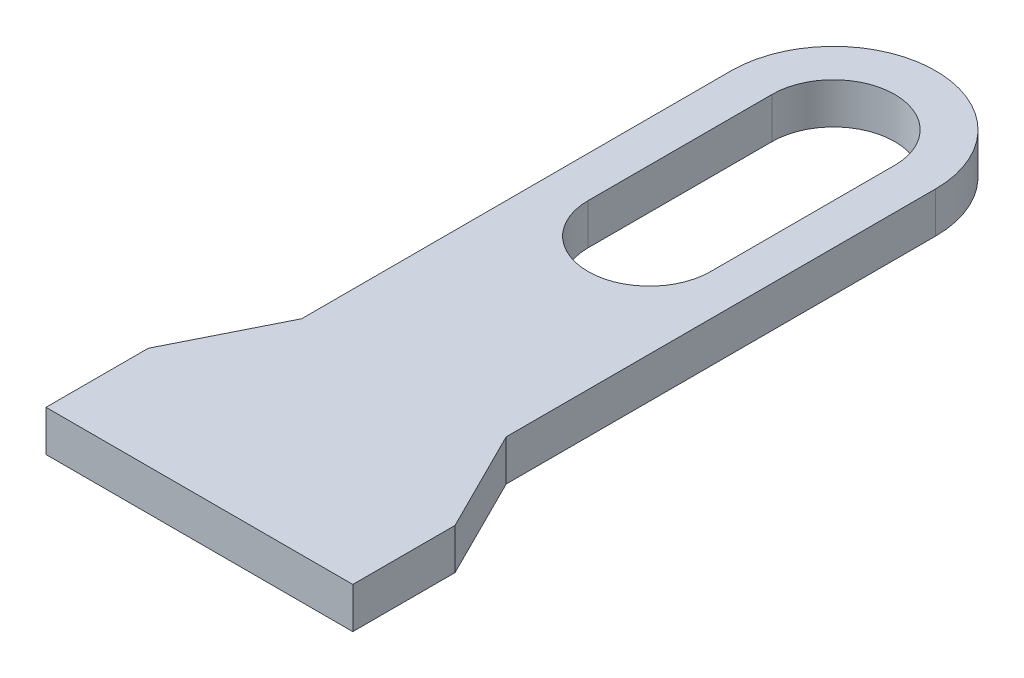
ISO-10303-21;
HEADER;
FILE_DESCRIPTION(('STEP AP214'),'2;1');
FILE_NAME('part.step','',(''),(''),'','','');
FILE_SCHEMA(('AUTOMOTIVE_DESIGN { 1 0 10303 214 1 1 1 1 }'));
ENDSEC;
DATA;
#1=APPLICATION_CONTEXT('core data for automotive mechanical design processes');
#2=APPLICATION_PROTOCOL_DEFINITION('international standard','automotive_design',2000,#1);
#3=PRODUCT_CONTEXT('',#1,'mechanical');
#4=PRODUCT('Part','Part','',(#3));
#5=PRODUCT_RELATED_PRODUCT_CATEGORY('part','',(#4));
#6=PRODUCT_DEFINITION_FORMATION('','',#4);
#7=PRODUCT_DEFINITION_CONTEXT('part definition',#1,'design');
#8=PRODUCT_DEFINITION('design','',#6,#7);
#9=PRODUCT_DEFINITION_SHAPE('','',#8);
#10=(LENGTH_UNIT() NAMED_UNIT(*) SI_UNIT(.MILLI.,.METRE.));
#11=(NAMED_UNIT(*) PLANE_ANGLE_UNIT() SI_UNIT($,.RADIAN.));
#12=(NAMED_UNIT(*) SI_UNIT($,.STERADIAN.) SOLID_ANGLE_UNIT());
#13=UNCERTAINTY_MEASURE_WITH_UNIT(LENGTH_MEASURE(1.E-05),#10,'distance_accuracy_value','');
#14=(GEOMETRIC_REPRESENTATION_CONTEXT(3) GLOBAL_UNCERTAINTY_ASSIGNED_CONTEXT((#13)) GLOBAL_UNIT_ASSIGNED_CONTEXT((#10,
#11,#12)) REPRESENTATION_CONTEXT('',''));
#15=CARTESIAN_POINT('',(0.,0.,0.));
#16=DIRECTION('',(0.,0.,1.));
#17=DIRECTION('',(1.,0.,0.));
#18=AXIS2_PLACEMENT_3D('',#15,#16,#17);
#19=CARTESIAN_POINT('',(-1.5,0.4,0.));
#20=DIRECTION('',(-1.,0.,0.));
#21=DIRECTION('',(0.,0.,1.));
#22=AXIS2_PLACEMENT_3D('',#19,#20,#21);
#23=PLANE('',#22);
#24=DIRECTION('',(0.,0.,-1.));
#25=VECTOR('',#24,1.);
#26=CARTESIAN_POINT('',(-1.5,0.,0.));
#27=LINE('',#26,#25);
#28=CARTESIAN_POINT('',(-1.5,0.,0.));
#29=VERTEX_POINT('',#28);
#30=CARTESIAN_POINT('',(-1.5,0.,-1.));
#31=VERTEX_POINT('',#30);
#32=EDGE_CURVE('E174',#29,#31,#27,.T.);
#33=ORIENTED_EDGE('',*,*,#32,.F.);
#34=DIRECTION('',(0.,-1.,0.));
#35=VECTOR('',#34,1.);
#36=CARTESIAN_POINT('',(-1.5,0.4,0.));
#37=LINE('',#36,#35);
#38=CARTESIAN_POINT('',(-1.5,0.4,0.));
#39=VERTEX_POINT('',#38);
#40=EDGE_CURVE('E11',#39,#29,#37,.T.);
#41=ORIENTED_EDGE('',*,*,#40,.F.);
#42=DIRECTION('',(0.,0.,-1.));
#43=VECTOR('',#42,1.);
#44=CARTESIAN_POINT('',(-1.5,0.4,0.));
#45=LINE('',#44,#43);
#46=CARTESIAN_POINT('',(-1.5,0.4,-1.));
#47=VERTEX_POINT('',#46);
#48=EDGE_CURVE('E275',#39,#47,#45,.T.);
#49=ORIENTED_EDGE('',*,*,#48,.T.);
#50=DIRECTION('',(0.,-1.,0.));
#51=VECTOR('',#50,1.);
#52=CARTESIAN_POINT('',(-1.5,0.4,-1.));
#53=LINE('',#52,#51);
#54=EDGE_CURVE('E57',#47,#31,#53,.T.);
#55=ORIENTED_EDGE('',*,*,#54,.T.);
#56=EDGE_LOOP('',(#33,#41,#49,#55));
#57=FACE_BOUND('',#56,.T.);
#58=ADVANCED_FACE('F38',(#57),#23,.T.);
#59=CARTESIAN_POINT('',(0.,0.4,0.));
#60=DIRECTION('',(0.,0.,1.));
#61=DIRECTION('',(1.,0.,0.));
#62=AXIS2_PLACEMENT_3D('',#59,#60,#61);
#63=PLANE('',#62);
#64=DIRECTION('',(-1.,0.,0.));
#65=VECTOR('',#64,1.);
#66=CARTESIAN_POINT('',(0.,0.,0.));
#67=LINE('',#66,#65);
#68=CARTESIAN_POINT('',(1.5,0.,0.));
#69=VERTEX_POINT('',#68);
#70=EDGE_CURVE('E176',#69,#29,#67,.T.);
#71=ORIENTED_EDGE('',*,*,#70,.F.);
#72=DIRECTION('',(0.,-1.,0.));
#73=VECTOR('',#72,1.);
#74=CARTESIAN_POINT('',(1.5,0.4,0.));
#75=LINE('',#74,#73);
#76=CARTESIAN_POINT('',(1.5,0.4,0.));
#77=VERTEX_POINT('',#76);
#78=EDGE_CURVE('E48',#77,#69,#75,.T.);
#79=ORIENTED_EDGE('',*,*,#78,.F.);
#80=DIRECTION('',(-1.,0.,0.));
#81=VECTOR('',#80,1.);
#82=CARTESIAN_POINT('',(0.,0.4,0.));
#83=LINE('',#82,#81);
#84=EDGE_CURVE('E277',#77,#39,#83,.T.);
#85=ORIENTED_EDGE('',*,*,#84,.T.);
#86=ORIENTED_EDGE('',*,*,#40,.T.);
#87=EDGE_LOOP('',(#71,#79,#85,#86));
#88=FACE_BOUND('',#87,.T.);
#89=ADVANCED_FACE('F237',(#88),#63,.T.);
#90=CARTESIAN_POINT('',(1.5,0.4,0.));
#91=DIRECTION('',(-1.,0.,0.));
#92=DIRECTION('',(0.,0.,1.));
#93=AXIS2_PLACEMENT_3D('',#90,#91,#92);
#94=PLANE('',#93);
#95=DIRECTION('',(0.,0.,-1.));
#96=VECTOR('',#95,1.);
#97=CARTESIAN_POINT('',(1.5,0.,0.));
#98=LINE('',#97,#96);
#99=CARTESIAN_POINT('',(1.5,0.,-1.));
#100=VERTEX_POINT('',#99);
#101=EDGE_CURVE('E179',#69,#100,#98,.T.);
#102=ORIENTED_EDGE('',*,*,#101,.T.);
#103=DIRECTION('',(0.,-1.,0.));
#104=VECTOR('',#103,1.);
#105=CARTESIAN_POINT('',(1.5,0.4,-1.));
#106=LINE('',#105,#104);
#107=CARTESIAN_POINT('',(1.5,0.4,-1.));
#108=VERTEX_POINT('',#107);
#109=EDGE_CURVE('E201',#108,#100,#106,.T.);
#110=ORIENTED_EDGE('',*,*,#109,.F.);
#111=DIRECTION('',(0.,0.,-1.));
#112=VECTOR('',#111,1.);
#113=CARTESIAN_POINT('',(1.5,0.4,0.));
#114=LINE('',#113,#112);
#115=EDGE_CURVE('E280',#77,#108,#114,.T.);
#116=ORIENTED_EDGE('',*,*,#115,.F.);
#117=ORIENTED_EDGE('',*,*,#78,.T.);
#118=EDGE_LOOP('',(#102,#110,#116,#117));
#119=FACE_BOUND('',#118,.T.);
#120=ADVANCED_FACE('F242',(#119),#94,.F.);
#121=CARTESIAN_POINT('',(1.6,0.4,-0.8));
#122=DIRECTION('',(-0.894427190999916,0.,0.447213595499958));
#123=DIRECTION('',(0.447213595499958,0.,0.894427190999916));
#124=AXIS2_PLACEMENT_3D('',#121,#122,#123);
#125=PLANE('',#124);
#126=DIRECTION('',(-0.447213595499958,0.,-0.894427190999916));
#127=VECTOR('',#126,1.);
#128=CARTESIAN_POINT('',(1.6,0.,-0.8));
#129=LINE('',#128,#127);
#130=CARTESIAN_POINT('',(1.,0.,-2.));
#131=VERTEX_POINT('',#130);
#132=EDGE_CURVE('E182',#100,#131,#129,.T.);
#133=ORIENTED_EDGE('',*,*,#132,.T.);
#134=DIRECTION('',(0.,-1.,0.));
#135=VECTOR('',#134,1.);
#136=CARTESIAN_POINT('',(1.,0.4,-2.));
#137=LINE('',#136,#135);
#138=CARTESIAN_POINT('',(1.,0.4,-2.));
#139=VERTEX_POINT('',#138);
#140=EDGE_CURVE('E198',#139,#131,#137,.T.);
#141=ORIENTED_EDGE('',*,*,#140,.F.);
#142=DIRECTION('',(-0.447213595499958,0.,-0.894427190999916));
#143=VECTOR('',#142,1.);
#144=CARTESIAN_POINT('',(1.6,0.4,-0.8));
#145=LINE('',#144,#143);
#146=EDGE_CURVE('E283',#108,#139,#145,.T.);
#147=ORIENTED_EDGE('',*,*,#146,.F.);
#148=ORIENTED_EDGE('',*,*,#109,.T.);
#149=EDGE_LOOP('',(#133,#141,#147,#148));
#150=FACE_BOUND('',#149,.T.);
#151=ADVANCED_FACE('F248',(#150),#125,.F.);
#152=CARTESIAN_POINT('',(1.,0.4,0.));
#153=DIRECTION('',(-1.,0.,0.));
#154=DIRECTION('',(0.,0.,1.));
#155=AXIS2_PLACEMENT_3D('',#152,#153,#154);
#156=PLANE('',#155);
#157=DIRECTION('',(0.,0.,-1.));
#158=VECTOR('',#157,1.);
#159=CARTESIAN_POINT('',(1.,0.,0.));
#160=LINE('',#159,#158);
#161=CARTESIAN_POINT('',(1.,0.,-6.2));
#162=VERTEX_POINT('',#161);
#163=EDGE_CURVE('E185',#131,#162,#160,.T.);
#164=ORIENTED_EDGE('',*,*,#163,.T.);
#165=DIRECTION('',(0.,-1.,0.));
#166=VECTOR('',#165,1.);
#167=CARTESIAN_POINT('',(1.,0.4,-6.2));
#168=LINE('',#167,#166);
#169=CARTESIAN_POINT('',(1.,0.4,-6.2));
#170=VERTEX_POINT('',#169);
#171=EDGE_CURVE('E143',#170,#162,#168,.T.);
#172=ORIENTED_EDGE('',*,*,#171,.F.);
#173=DIRECTION('',(0.,0.,-1.));
#174=VECTOR('',#173,1.);
#175=CARTESIAN_POINT('',(1.,0.4,0.));
#176=LINE('',#175,#174);
#177=EDGE_CURVE('E152',#139,#170,#176,.T.);
#178=ORIENTED_EDGE('',*,*,#177,.F.);
#179=ORIENTED_EDGE('',*,*,#140,.T.);
#180=EDGE_LOOP('',(#164,#172,#178,#179));
#181=FACE_BOUND('',#180,.T.);
#182=ADVANCED_FACE('F252',(#181),#156,.F.);
#183=CARTESIAN_POINT('',(0.,0.4,-6.2));
#184=DIRECTION('',(0.,-1.,0.));
#185=DIRECTION('',(0.,0.,-1.));
#186=AXIS2_PLACEMENT_3D('',#183,#184,#185);
#187=CYLINDRICAL_SURFACE('',#186,1.);
#188=CARTESIAN_POINT('',(0.,0.,-6.2));
#189=DIRECTION('',(0.,1.,0.));
#190=DIRECTION('',(0.,0.,1.));
#191=AXIS2_PLACEMENT_3D('',#188,#189,#190);
#192=CIRCLE('',#191,1.);
#193=CARTESIAN_POINT('',(-1.,0.,-6.2));
#194=VERTEX_POINT('',#193);
#195=EDGE_CURVE('E139',#194,#162,#192,.F.);
#196=ORIENTED_EDGE('',*,*,#195,.F.);
#197=DIRECTION('',(0.,-1.,0.));
#198=VECTOR('',#197,1.);
#199=CARTESIAN_POINT('',(-1.,0.4,-6.2));
#200=LINE('',#199,#198);
#201=CARTESIAN_POINT('',(-1.,0.4,-6.2));
#202=VERTEX_POINT('',#201);
#203=EDGE_CURVE('E134',#202,#194,#200,.T.);
#204=ORIENTED_EDGE('',*,*,#203,.F.);
#205=CARTESIAN_POINT('',(0.,0.4,-6.2));
#206=DIRECTION('',(0.,1.,0.));
#207=DIRECTION('',(0.,0.,1.));
#208=AXIS2_PLACEMENT_3D('',#205,#206,#207);
#209=CIRCLE('',#208,1.);
#210=EDGE_CURVE('E137',#202,#170,#209,.F.);
#211=ORIENTED_EDGE('',*,*,#210,.T.);
#212=ORIENTED_EDGE('',*,*,#171,.T.);
#213=EDGE_LOOP('',(#196,#204,#211,#212));
#214=FACE_BOUND('',#213,.T.);
#215=ADVANCED_FACE('F136',(#214),#187,.T.);
#216=CARTESIAN_POINT('',(-1.,0.4,0.));
#217=DIRECTION('',(-1.,0.,0.));
#218=DIRECTION('',(0.,0.,1.));
#219=AXIS2_PLACEMENT_3D('',#216,#217,#218);
#220=PLANE('',#219);
#221=DIRECTION('',(0.,0.,-1.));
#222=VECTOR('',#221,1.);
#223=CARTESIAN_POINT('',(-1.,0.,0.));
#224=LINE('',#223,#222);
#225=CARTESIAN_POINT('',(-1.,0.,-2.));
#226=VERTEX_POINT('',#225);
#227=EDGE_CURVE('E189',#226,#194,#224,.T.);
#228=ORIENTED_EDGE('',*,*,#227,.F.);
#229=DIRECTION('',(0.,-1.,0.));
#230=VECTOR('',#229,1.);
#231=CARTESIAN_POINT('',(-1.,0.4,-2.));
#232=LINE('',#231,#230);
#233=CARTESIAN_POINT('',(-1.,0.4,-2.));
#234=VERTEX_POINT('',#233);
#235=EDGE_CURVE('E94',#234,#226,#232,.T.);
#236=ORIENTED_EDGE('',*,*,#235,.F.);
#237=DIRECTION('',(0.,0.,-1.));
#238=VECTOR('',#237,1.);
#239=CARTESIAN_POINT('',(-1.,0.4,0.));
#240=LINE('',#239,#238);
#241=EDGE_CURVE('E150',#234,#202,#240,.T.);
#242=ORIENTED_EDGE('',*,*,#241,.T.);
#243=ORIENTED_EDGE('',*,*,#203,.T.);
#244=EDGE_LOOP('',(#228,#236,#242,#243));
#245=FACE_BOUND('',#244,.T.);
#246=ADVANCED_FACE('F155',(#245),#220,.T.);
#247=CARTESIAN_POINT('',(0.,0.4,-4.4));
#248=DIRECTION('',(0.,-1.,0.));
#249=DIRECTION('',(0.,0.,-1.));
#250=AXIS2_PLACEMENT_3D('',#247,#248,#249);
#251=CYLINDRICAL_SURFACE('',#250,0.6);
#252=CARTESIAN_POINT('',(0.,0.,-4.4));
#253=DIRECTION('',(0.,1.,0.));
#254=DIRECTION('',(0.,0.,1.));
#255=AXIS2_PLACEMENT_3D('',#252,#253,#254);
#256=CIRCLE('',#255,0.6);
#257=CARTESIAN_POINT('',(-0.6,0.,-4.4));
#258=VERTEX_POINT('',#257);
#259=CARTESIAN_POINT('',(0.6,0.,-4.4));
#260=VERTEX_POINT('',#259);
#261=EDGE_CURVE('E162',#258,#260,#256,.T.);
#262=ORIENTED_EDGE('',*,*,#261,.F.);
#263=DIRECTION('',(0.,-1.,0.));
#264=VECTOR('',#263,1.);
#265=CARTESIAN_POINT('',(-0.6,0.4,-4.4));
#266=LINE('',#265,#264);
#267=CARTESIAN_POINT('',(-0.6,0.4,-4.4));
#268=VERTEX_POINT('',#267);
#269=EDGE_CURVE('E42',#268,#258,#266,.T.);
#270=ORIENTED_EDGE('',*,*,#269,.F.);
#271=CARTESIAN_POINT('',(0.,0.4,-4.4));
#272=DIRECTION('',(0.,1.,0.));
#273=DIRECTION('',(0.,0.,1.));
#274=AXIS2_PLACEMENT_3D('',#271,#272,#273);
#275=CIRCLE('',#274,0.6);
#276=CARTESIAN_POINT('',(0.6,0.4,-4.4));
#277=VERTEX_POINT('',#276);
#278=EDGE_CURVE('E194',#268,#277,#275,.T.);
#279=ORIENTED_EDGE('',*,*,#278,.T.);
#280=DIRECTION('',(0.,-1.,0.));
#281=VECTOR('',#280,1.);
#282=CARTESIAN_POINT('',(0.6,0.4,-4.4));
#283=LINE('',#282,#281);
#284=EDGE_CURVE('E158',#277,#260,#283,.T.);
#285=ORIENTED_EDGE('',*,*,#284,.T.);
#286=EDGE_LOOP('',(#262,#270,#279,#285));
#287=FACE_BOUND('',#286,.T.);
#288=ADVANCED_FACE('F40',(#287),#251,.F.);
#289=CARTESIAN_POINT('',(-0.6,0.4,0.));
#290=DIRECTION('',(-1.,0.,0.));
#291=DIRECTION('',(0.,0.,1.));
#292=AXIS2_PLACEMENT_3D('',#289,#290,#291);
#293=PLANE('',#292);
#294=DIRECTION('',(0.,0.,-1.));
#295=VECTOR('',#294,1.);
#296=CARTESIAN_POINT('',(-0.6,0.,0.));
#297=LINE('',#296,#295);
#298=CARTESIAN_POINT('',(-0.6,0.,-6.2));
#299=VERTEX_POINT('',#298);
#300=EDGE_CURVE('E165',#258,#299,#297,.T.);
#301=ORIENTED_EDGE('',*,*,#300,.T.);
#302=DIRECTION('',(0.,-1.,0.));
#303=VECTOR('',#302,1.);
#304=CARTESIAN_POINT('',(-0.6,0.4,-6.2));
#305=LINE('',#304,#303);
#306=CARTESIAN_POINT('',(-0.6,0.4,-6.2));
#307=VERTEX_POINT('',#306);
#308=EDGE_CURVE('E207',#307,#299,#305,.T.);
#309=ORIENTED_EDGE('',*,*,#308,.F.);
#310=DIRECTION('',(0.,0.,-1.));
#311=VECTOR('',#310,1.);
#312=CARTESIAN_POINT('',(-0.6,0.4,0.));
#313=LINE('',#312,#311);
#314=EDGE_CURVE('E215',#268,#307,#313,.T.);
#315=ORIENTED_EDGE('',*,*,#314,.F.);
#316=ORIENTED_EDGE('',*,*,#269,.T.);
#317=EDGE_LOOP('',(#301,#309,#315,#316));
#318=FACE_BOUND('',#317,.T.);
#319=ADVANCED_FACE('F214',(#318),#293,.F.);
#320=CARTESIAN_POINT('',(0.,0.4,-6.2));
#321=DIRECTION('',(0.,-1.,0.));
#322=DIRECTION('',(0.,0.,-1.));
#323=AXIS2_PLACEMENT_3D('',#320,#321,#322);
#324=CYLINDRICAL_SURFACE('',#323,0.6);
#325=CARTESIAN_POINT('',(0.,0.,-6.2));
#326=DIRECTION('',(0.,1.,0.));
#327=DIRECTION('',(0.,0.,1.));
#328=AXIS2_PLACEMENT_3D('',#325,#326,#327);
#329=CIRCLE('',#328,0.6);
#330=CARTESIAN_POINT('',(0.6,0.,-6.2));
#331=VERTEX_POINT('',#330);
#332=EDGE_CURVE('E168',#331,#299,#329,.T.);
#333=ORIENTED_EDGE('',*,*,#332,.F.);
#334=DIRECTION('',(0.,-1.,0.));
#335=VECTOR('',#334,1.);
#336=CARTESIAN_POINT('',(0.6,0.4,-6.2));
#337=LINE('',#336,#335);
#338=CARTESIAN_POINT('',(0.6,0.4,-6.2));
#339=VERTEX_POINT('',#338);
#340=EDGE_CURVE('E206',#339,#331,#337,.T.);
#341=ORIENTED_EDGE('',*,*,#340,.F.);
#342=CARTESIAN_POINT('',(0.,0.4,-6.2));
#343=DIRECTION('',(0.,1.,0.));
#344=DIRECTION('',(0.,0.,1.));
#345=AXIS2_PLACEMENT_3D('',#342,#343,#344);
#346=CIRCLE('',#345,0.6);
#347=EDGE_CURVE('E270',#339,#307,#346,.T.);
#348=ORIENTED_EDGE('',*,*,#347,.T.);
#349=ORIENTED_EDGE('',*,*,#308,.T.);
#350=EDGE_LOOP('',(#333,#341,#348,#349));
#351=FACE_BOUND('',#350,.T.);
#352=ADVANCED_FACE('F227',(#351),#324,.F.);
#353=CARTESIAN_POINT('',(0.6,0.4,0.));
#354=DIRECTION('',(-1.,0.,0.));
#355=DIRECTION('',(0.,0.,1.));
#356=AXIS2_PLACEMENT_3D('',#353,#354,#355);
#357=PLANE('',#356);
#358=DIRECTION('',(0.,0.,-1.));
#359=VECTOR('',#358,1.);
#360=CARTESIAN_POINT('',(0.6,0.,0.));
#361=LINE('',#360,#359);
#362=EDGE_CURVE('E171',#260,#331,#361,.T.);
#363=ORIENTED_EDGE('',*,*,#362,.F.);
#364=ORIENTED_EDGE('',*,*,#284,.F.);
#365=DIRECTION('',(0.,0.,-1.));
#366=VECTOR('',#365,1.);
#367=CARTESIAN_POINT('',(0.6,0.4,0.));
#368=LINE('',#367,#366);
#369=EDGE_CURVE('E225',#277,#339,#368,.T.);
#370=ORIENTED_EDGE('',*,*,#369,.T.);
#371=ORIENTED_EDGE('',*,*,#340,.T.);
#372=EDGE_LOOP('',(#363,#364,#370,#371));
#373=FACE_BOUND('',#372,.T.);
#374=ADVANCED_FACE('F224',(#373),#357,.T.);
#375=CARTESIAN_POINT('',(-1.6,0.4,-0.8));
#376=DIRECTION('',(-0.894427190999916,0.,-0.447213595499958));
#377=DIRECTION('',(-0.447213595499958,0.,0.894427190999916));
#378=AXIS2_PLACEMENT_3D('',#375,#376,#377);
#379=PLANE('',#378);
#380=DIRECTION('',(0.447213595499958,0.,-0.894427190999916));
#381=VECTOR('',#380,1.);
#382=CARTESIAN_POINT('',(-1.6,0.,-0.8));
#383=LINE('',#382,#381);
#384=EDGE_CURVE('E191',#31,#226,#383,.T.);
#385=ORIENTED_EDGE('',*,*,#384,.F.);
#386=ORIENTED_EDGE('',*,*,#54,.F.);
#387=DIRECTION('',(0.447213595499958,0.,-0.894427190999916));
#388=VECTOR('',#387,1.);
#389=CARTESIAN_POINT('',(-1.6,0.4,-0.8));
#390=LINE('',#389,#388);
#391=EDGE_CURVE('E156',#47,#234,#390,.T.);
#392=ORIENTED_EDGE('',*,*,#391,.T.);
#393=ORIENTED_EDGE('',*,*,#235,.T.);
#394=EDGE_LOOP('',(#385,#386,#392,#393));
#395=FACE_BOUND('',#394,.T.);
#396=ADVANCED_FACE('F234',(#395),#379,.T.);
#397=CARTESIAN_POINT('',(0.,0.4,0.));
#398=DIRECTION('',(0.,1.,0.));
#399=DIRECTION('',(0.,0.,1.));
#400=AXIS2_PLACEMENT_3D('',#397,#398,#399);
#401=PLANE('',#400);
#402=ORIENTED_EDGE('',*,*,#278,.F.);
#403=ORIENTED_EDGE('',*,*,#314,.T.);
#404=ORIENTED_EDGE('',*,*,#347,.F.);
#405=ORIENTED_EDGE('',*,*,#369,.F.);
#406=EDGE_LOOP('',(#402,#403,#404,#405));
#407=FACE_BOUND('',#406,.T.);
#408=ORIENTED_EDGE('',*,*,#48,.F.);
#409=ORIENTED_EDGE('',*,*,#84,.F.);
#410=ORIENTED_EDGE('',*,*,#115,.T.);
#411=ORIENTED_EDGE('',*,*,#146,.T.);
#412=ORIENTED_EDGE('',*,*,#177,.T.);
#413=ORIENTED_EDGE('',*,*,#210,.F.);
#414=ORIENTED_EDGE('',*,*,#241,.F.);
#415=ORIENTED_EDGE('',*,*,#391,.F.);
#416=EDGE_LOOP('',(#408,#409,#410,#411,#412,#413,#414,#415));
#417=FACE_BOUND('',#416,.T.);
#418=ADVANCED_FACE('F148',(#407,#417),#401,.T.);
#419=CARTESIAN_POINT('',(0.,0.,0.));
#420=DIRECTION('',(0.,1.,0.));
#421=DIRECTION('',(0.,0.,1.));
#422=AXIS2_PLACEMENT_3D('',#419,#420,#421);
#423=PLANE('',#422);
#424=ORIENTED_EDGE('',*,*,#261,.T.);
#425=ORIENTED_EDGE('',*,*,#362,.T.);
#426=ORIENTED_EDGE('',*,*,#332,.T.);
#427=ORIENTED_EDGE('',*,*,#300,.F.);
#428=EDGE_LOOP('',(#424,#425,#426,#427));
#429=FACE_BOUND('',#428,.T.);
#430=ORIENTED_EDGE('',*,*,#32,.T.);
#431=ORIENTED_EDGE('',*,*,#384,.T.);
#432=ORIENTED_EDGE('',*,*,#227,.T.);
#433=ORIENTED_EDGE('',*,*,#195,.T.);
#434=ORIENTED_EDGE('',*,*,#163,.F.);
#435=ORIENTED_EDGE('',*,*,#132,.F.);
#436=ORIENTED_EDGE('',*,*,#101,.F.);
#437=ORIENTED_EDGE('',*,*,#70,.T.);
#438=EDGE_LOOP('',(#430,#431,#432,#433,#434,#435,#436,#437));
#439=FACE_BOUND('',#438,.T.);
#440=ADVANCED_FACE('F218',(#429,#439),#423,.F.);
#441=CLOSED_SHELL('',(#58,#89,#120,#151,#182,#215,#246,#288,#319,#352,#374,#396,#418,#440));
#442=MANIFOLD_SOLID_BREP('B2',#441);
#443=ADVANCED_BREP_SHAPE_REPRESENTATION('',(#18,#442),#14);
#444=SHAPE_DEFINITION_REPRESENTATION(#9,#443);
ENDSEC;
END-ISO-10303-21;
